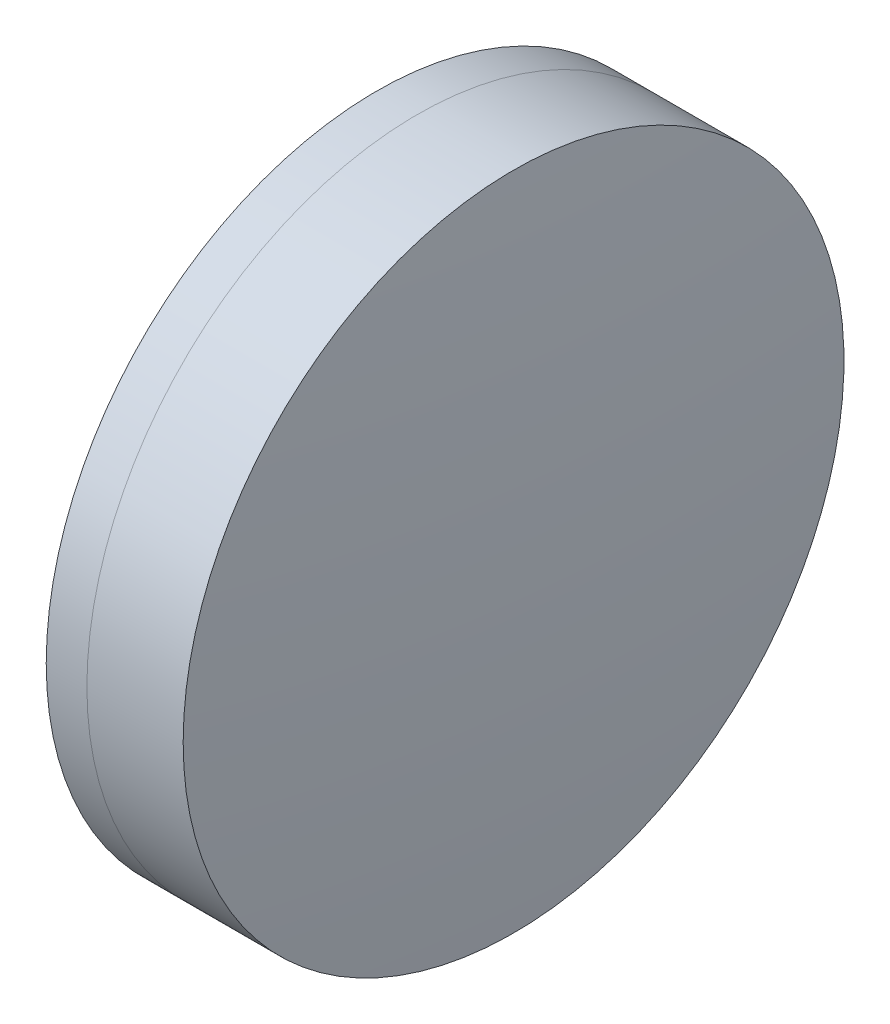
ISO-10303-21;
HEADER;
FILE_DESCRIPTION(('STEP AP214'),'2;1');
FILE_NAME('part.step','',(''),(''),'','','');
FILE_SCHEMA(('AUTOMOTIVE_DESIGN { 1 0 10303 214 1 1 1 1 }'));
ENDSEC;
DATA;
#1=APPLICATION_CONTEXT('core data for automotive mechanical design processes');
#2=APPLICATION_PROTOCOL_DEFINITION('international standard','automotive_design',2000,#1);
#3=PRODUCT_CONTEXT('',#1,'mechanical');
#4=PRODUCT('Part','Part','',(#3));
#5=PRODUCT_RELATED_PRODUCT_CATEGORY('part','',(#4));
#6=PRODUCT_DEFINITION_FORMATION('','',#4);
#7=PRODUCT_DEFINITION_CONTEXT('part definition',#1,'design');
#8=PRODUCT_DEFINITION('design','',#6,#7);
#9=PRODUCT_DEFINITION_SHAPE('','',#8);
#10=(LENGTH_UNIT() NAMED_UNIT(*) SI_UNIT(.MILLI.,.METRE.));
#11=(NAMED_UNIT(*) PLANE_ANGLE_UNIT() SI_UNIT($,.RADIAN.));
#12=(NAMED_UNIT(*) SI_UNIT($,.STERADIAN.) SOLID_ANGLE_UNIT());
#13=UNCERTAINTY_MEASURE_WITH_UNIT(LENGTH_MEASURE(1.E-05),#10,'distance_accuracy_value','');
#14=(GEOMETRIC_REPRESENTATION_CONTEXT(3) GLOBAL_UNCERTAINTY_ASSIGNED_CONTEXT((#13)) GLOBAL_UNIT_ASSIGNED_CONTEXT((#10,
#11,#12)) REPRESENTATION_CONTEXT('',''));
#15=CARTESIAN_POINT('',(0.,0.,0.));
#16=DIRECTION('',(0.,0.,1.));
#17=DIRECTION('',(1.,0.,0.));
#18=AXIS2_PLACEMENT_3D('',#15,#16,#17);
#19=CARTESIAN_POINT('',(14.8796689735747,0.,0.));
#20=DIRECTION('',(-1.,0.,0.));
#21=DIRECTION('',(0.,0.,1.));
#22=AXIS2_PLACEMENT_3D('',#19,#20,#21);
#23=SPHERICAL_SURFACE('',#22,47.0220000000001);
#24=CARTESIAN_POINT('',(60.209774687107,0.,0.));
#25=DIRECTION('',(-1.,0.,0.));
#26=DIRECTION('',(0.,0.,1.));
#27=AXIS2_PLACEMENT_3D('',#24,#25,#26);
#28=CIRCLE('',#27,12.5);
#29=CARTESIAN_POINT('',(60.209774687107,0.,12.5));
#30=VERTEX_POINT('',#29);
#31=EDGE_CURVE('E11',#30,#30,#28,.T.);
#32=ORIENTED_EDGE('',*,*,#31,.T.);
#33=EDGE_LOOP('',(#32));
#34=FACE_BOUND('',#33,.T.);
#35=ADVANCED_FACE('F45',(#34),#23,.F.);
#36=CARTESIAN_POINT('',(-0.551919992657797,0.,0.));
#37=DIRECTION('',(-1.,0.,0.));
#38=DIRECTION('',(0.,0.,1.));
#39=AXIS2_PLACEMENT_3D('',#36,#37,#38);
#40=CYLINDRICAL_SURFACE('',#39,12.5);
#41=CARTESIAN_POINT('',(63.8523839870959,0.,0.));
#42=DIRECTION('',(-1.,0.,0.));
#43=DIRECTION('',(0.,0.,1.));
#44=AXIS2_PLACEMENT_3D('',#41,#42,#43);
#45=CIRCLE('',#44,12.5);
#46=CARTESIAN_POINT('',(63.8523839870959,0.,12.5));
#47=VERTEX_POINT('',#46);
#48=EDGE_CURVE('E51',#47,#47,#45,.T.);
#49=ORIENTED_EDGE('',*,*,#48,.T.);
#50=EDGE_LOOP('',(#49));
#51=FACE_BOUND('',#50,.T.);
#52=ORIENTED_EDGE('',*,*,#31,.F.);
#53=EDGE_LOOP('',(#52));
#54=FACE_BOUND('',#53,.T.);
#55=ADVANCED_FACE('F57',(#51,#54),#40,.T.);
#56=CARTESIAN_POINT('',(-78.1033310264252,0.,0.));
#57=DIRECTION('',(-1.,0.,0.));
#58=DIRECTION('',(0.,0.,1.));
#59=AXIS2_PLACEMENT_3D('',#56,#57,#58);
#60=SPHERICAL_SURFACE('',#59,142.505);
#61=ORIENTED_EDGE('',*,*,#48,.F.);
#62=EDGE_LOOP('',(#61));
#63=FACE_BOUND('',#62,.T.);
#64=ADVANCED_FACE('F60',(#63),#60,.T.);
#65=CLOSED_SHELL('',(#35,#55,#64));
#66=MANIFOLD_SOLID_BREP('B2',#65);
#67=CARTESIAN_POINT('',(120.567668973575,0.,0.));
#68=DIRECTION('',(-1.,0.,0.));
#69=DIRECTION('',(0.,0.,1.));
#70=AXIS2_PLACEMENT_3D('',#67,#68,#69);
#71=SPHERICAL_SURFACE('',#70,63.146);
#72=CARTESIAN_POINT('',(58.6712448765399,0.,0.));
#73=DIRECTION('',(-1.,0.,0.));
#74=DIRECTION('',(0.,0.,1.));
#75=AXIS2_PLACEMENT_3D('',#72,#73,#74);
#76=CIRCLE('',#75,12.5);
#77=CARTESIAN_POINT('',(58.6712448765399,0.,12.5));
#78=VERTEX_POINT('',#77);
#79=EDGE_CURVE('E44',#78,#78,#76,.T.);
#80=ORIENTED_EDGE('',*,*,#79,.T.);
#81=EDGE_LOOP('',(#80));
#82=FACE_BOUND('',#81,.T.);
#83=ADVANCED_FACE('F86',(#82),#71,.T.);
#84=CARTESIAN_POINT('',(-9.70261217833668,0.,0.));
#85=DIRECTION('',(-1.,0.,0.));
#86=DIRECTION('',(0.,0.,1.));
#87=AXIS2_PLACEMENT_3D('',#84,#85,#86);
#88=CYLINDRICAL_SURFACE('',#87,12.5);
#89=CARTESIAN_POINT('',(60.209774687107,0.,0.));
#90=DIRECTION('',(-1.,0.,0.));
#91=DIRECTION('',(0.,0.,1.));
#92=AXIS2_PLACEMENT_3D('',#89,#90,#91);
#93=CIRCLE('',#92,12.5);
#94=CARTESIAN_POINT('',(60.209774687107,0.,12.5));
#95=VERTEX_POINT('',#94);
#96=EDGE_CURVE('E92',#95,#95,#93,.T.);
#97=ORIENTED_EDGE('',*,*,#96,.T.);
#98=EDGE_LOOP('',(#97));
#99=FACE_BOUND('',#98,.T.);
#100=ORIENTED_EDGE('',*,*,#79,.F.);
#101=EDGE_LOOP('',(#100));
#102=FACE_BOUND('',#101,.T.);
#103=ADVANCED_FACE('F98',(#99,#102),#88,.T.);
#104=CARTESIAN_POINT('',(14.8796689735747,0.,0.));
#105=DIRECTION('',(-1.,0.,0.));
#106=DIRECTION('',(0.,0.,1.));
#107=AXIS2_PLACEMENT_3D('',#104,#105,#106);
#108=SPHERICAL_SURFACE('',#107,47.0220000000001);
#109=ORIENTED_EDGE('',*,*,#96,.F.);
#110=EDGE_LOOP('',(#109));
#111=FACE_BOUND('',#110,.T.);
#112=ADVANCED_FACE('F101',(#111),#108,.T.);
#113=CLOSED_SHELL('',(#83,#103,#112));
#114=MANIFOLD_SOLID_BREP('B6',#113);
#115=ADVANCED_BREP_SHAPE_REPRESENTATION('',(#18,#66,#114),#14);
#116=SHAPE_DEFINITION_REPRESENTATION(#9,#115);
ENDSEC;
END-ISO-10303-21;
